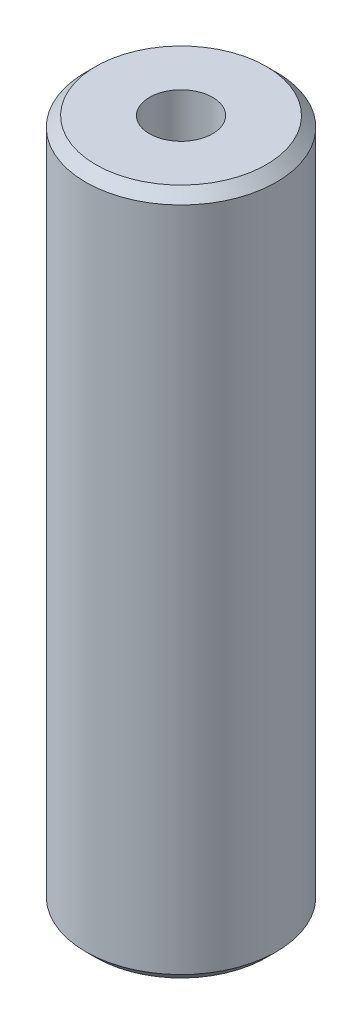
ISO-10303-21;
HEADER;
FILE_DESCRIPTION(('STEP AP214'),'2;1');
FILE_NAME('part.step','',(''),(''),'','','');
FILE_SCHEMA(('AUTOMOTIVE_DESIGN { 1 0 10303 214 1 1 1 1 }'));
ENDSEC;
DATA;
#1=APPLICATION_CONTEXT('core data for automotive mechanical design processes');
#2=APPLICATION_PROTOCOL_DEFINITION('international standard','automotive_design',2000,#1);
#3=PRODUCT_CONTEXT('',#1,'mechanical');
#4=PRODUCT('Part','Part','',(#3));
#5=PRODUCT_RELATED_PRODUCT_CATEGORY('part','',(#4));
#6=PRODUCT_DEFINITION_FORMATION('','',#4);
#7=PRODUCT_DEFINITION_CONTEXT('part definition',#1,'design');
#8=PRODUCT_DEFINITION('design','',#6,#7);
#9=PRODUCT_DEFINITION_SHAPE('','',#8);
#10=(LENGTH_UNIT() NAMED_UNIT(*) SI_UNIT(.MILLI.,.METRE.));
#11=(NAMED_UNIT(*) PLANE_ANGLE_UNIT() SI_UNIT($,.RADIAN.));
#12=(NAMED_UNIT(*) SI_UNIT($,.STERADIAN.) SOLID_ANGLE_UNIT());
#13=UNCERTAINTY_MEASURE_WITH_UNIT(LENGTH_MEASURE(1.E-05),#10,'distance_accuracy_value','');
#14=(GEOMETRIC_REPRESENTATION_CONTEXT(3) GLOBAL_UNCERTAINTY_ASSIGNED_CONTEXT((#13)) GLOBAL_UNIT_ASSIGNED_CONTEXT((#10,
#11,#12)) REPRESENTATION_CONTEXT('',''));
#15=CARTESIAN_POINT('',(0.,0.,0.));
#16=DIRECTION('',(0.,0.,1.));
#17=DIRECTION('',(1.,0.,0.));
#18=AXIS2_PLACEMENT_3D('',#15,#16,#17);
#19=CARTESIAN_POINT('',(0.,108.071181790834,0.));
#20=DIRECTION('',(0.,-1.,0.));
#21=DIRECTION('',(0.,0.,-1.));
#22=AXIS2_PLACEMENT_3D('',#19,#20,#21);
#23=CYLINDRICAL_SURFACE('',#22,15.);
#24=CARTESIAN_POINT('',(0.,106.479929511877,0.));
#25=DIRECTION('',(0.,1.,0.));
#26=DIRECTION('',(0.,0.,1.));
#27=AXIS2_PLACEMENT_3D('',#24,#25,#26);
#28=CIRCLE('',#27,15.);
#29=CARTESIAN_POINT('',(0.,106.479929511877,15.));
#30=VERTEX_POINT('',#29);
#31=EDGE_CURVE('E50',#30,#30,#28,.F.);
#32=ORIENTED_EDGE('',*,*,#31,.T.);
#33=EDGE_LOOP('',(#32));
#34=FACE_BOUND('',#33,.T.);
#35=CARTESIAN_POINT('',(0.,1.59125227895715,0.));
#36=DIRECTION('',(0.,1.,0.));
#37=DIRECTION('',(0.,0.,1.));
#38=AXIS2_PLACEMENT_3D('',#35,#36,#37);
#39=CIRCLE('',#38,15.);
#40=CARTESIAN_POINT('',(0.,1.59125227895715,15.));
#41=VERTEX_POINT('',#40);
#42=EDGE_CURVE('E51',#41,#41,#39,.T.);
#43=ORIENTED_EDGE('',*,*,#42,.T.);
#44=EDGE_LOOP('',(#43));
#45=FACE_BOUND('',#44,.T.);
#46=ADVANCED_FACE('F39',(#34,#45),#23,.T.);
#47=CARTESIAN_POINT('',(0.,108.071181790834,0.));
#48=DIRECTION('',(0.,1.,0.));
#49=DIRECTION('',(0.,0.,1.));
#50=AXIS2_PLACEMENT_3D('',#47,#48,#49);
#51=PLANE('',#50);
#52=CARTESIAN_POINT('',(0.,108.071181790834,0.));
#53=DIRECTION('',(0.,1.,0.));
#54=DIRECTION('',(0.,0.,1.));
#55=AXIS2_PLACEMENT_3D('',#52,#53,#54);
#56=CIRCLE('',#55,13.4087477210428);
#57=CARTESIAN_POINT('',(0.,108.071181790834,13.4087477210428));
#58=VERTEX_POINT('',#57);
#59=EDGE_CURVE('E54',#58,#58,#56,.T.);
#60=ORIENTED_EDGE('',*,*,#59,.T.);
#61=EDGE_LOOP('',(#60));
#62=FACE_BOUND('',#61,.T.);
#63=CARTESIAN_POINT('',(0.,108.071181790834,0.));
#64=DIRECTION('',(0.,1.,0.));
#65=DIRECTION('',(0.,0.,1.));
#66=AXIS2_PLACEMENT_3D('',#63,#64,#65);
#67=CIRCLE('',#66,4.97144902155037);
#68=CARTESIAN_POINT('',(0.,108.071181790834,4.97144902155037));
#69=VERTEX_POINT('',#68);
#70=EDGE_CURVE('E58',#69,#69,#67,.T.);
#71=ORIENTED_EDGE('',*,*,#70,.F.);
#72=EDGE_LOOP('',(#71));
#73=FACE_BOUND('',#72,.T.);
#74=ADVANCED_FACE('F69',(#62,#73),#51,.T.);
#75=CARTESIAN_POINT('',(0.,0.,0.));
#76=DIRECTION('',(0.,1.,0.));
#77=DIRECTION('',(0.,0.,1.));
#78=AXIS2_PLACEMENT_3D('',#75,#76,#77);
#79=PLANE('',#78);
#80=CARTESIAN_POINT('',(0.,0.,0.));
#81=DIRECTION('',(0.,1.,0.));
#82=DIRECTION('',(0.,0.,1.));
#83=AXIS2_PLACEMENT_3D('',#80,#81,#82);
#84=CIRCLE('',#83,13.4087477210428);
#85=CARTESIAN_POINT('',(0.,0.,13.4087477210428));
#86=VERTEX_POINT('',#85);
#87=EDGE_CURVE('E10',#86,#86,#84,.F.);
#88=ORIENTED_EDGE('',*,*,#87,.T.);
#89=EDGE_LOOP('',(#88));
#90=FACE_BOUND('',#89,.T.);
#91=CARTESIAN_POINT('',(0.,0.,0.));
#92=DIRECTION('',(0.,1.,0.));
#93=DIRECTION('',(0.,0.,1.));
#94=AXIS2_PLACEMENT_3D('',#91,#92,#93);
#95=CIRCLE('',#94,4.97144902155037);
#96=CARTESIAN_POINT('',(0.,0.,4.97144902155037));
#97=VERTEX_POINT('',#96);
#98=EDGE_CURVE('E63',#97,#97,#95,.T.);
#99=ORIENTED_EDGE('',*,*,#98,.T.);
#100=EDGE_LOOP('',(#99));
#101=FACE_BOUND('',#100,.T.);
#102=ADVANCED_FACE('F75',(#90,#101),#79,.F.);
#103=CARTESIAN_POINT('',(0.,108.071181790834,0.));
#104=DIRECTION('',(0.,-1.,0.));
#105=DIRECTION('',(0.,0.,-1.));
#106=AXIS2_PLACEMENT_3D('',#103,#104,#105);
#107=CYLINDRICAL_SURFACE('',#106,4.97144902155037);
#108=ORIENTED_EDGE('',*,*,#70,.T.);
#109=EDGE_LOOP('',(#108));
#110=FACE_BOUND('',#109,.T.);
#111=ORIENTED_EDGE('',*,*,#98,.F.);
#112=EDGE_LOOP('',(#111));
#113=FACE_BOUND('',#112,.T.);
#114=ADVANCED_FACE('F70',(#110,#113),#107,.F.);
#115=CARTESIAN_POINT('',(0.,108.071181790834,0.));
#116=DIRECTION('',(0.,-1.,0.));
#117=DIRECTION('',(0.,0.,-1.));
#118=AXIS2_PLACEMENT_3D('',#115,#116,#117);
#119=CONICAL_SURFACE('',#118,13.4087477210428,0.785398163397444);
#120=ORIENTED_EDGE('',*,*,#31,.F.);
#121=EDGE_LOOP('',(#120));
#122=FACE_BOUND('',#121,.T.);
#123=ORIENTED_EDGE('',*,*,#59,.F.);
#124=EDGE_LOOP('',(#123));
#125=FACE_BOUND('',#124,.T.);
#126=ADVANCED_FACE('F81',(#122,#125),#119,.T.);
#127=CARTESIAN_POINT('',(0.,1.59125227895715,0.));
#128=DIRECTION('',(0.,1.,0.));
#129=DIRECTION('',(0.,0.,1.));
#130=AXIS2_PLACEMENT_3D('',#127,#128,#129);
#131=CONICAL_SURFACE('',#130,15.,0.785398163397448);
#132=ORIENTED_EDGE('',*,*,#87,.F.);
#133=EDGE_LOOP('',(#132));
#134=FACE_BOUND('',#133,.T.);
#135=ORIENTED_EDGE('',*,*,#42,.F.);
#136=EDGE_LOOP('',(#135));
#137=FACE_BOUND('',#136,.T.);
#138=ADVANCED_FACE('F45',(#134,#137),#131,.T.);
#139=CLOSED_SHELL('',(#46,#74,#102,#114,#126,#138));
#140=MANIFOLD_SOLID_BREP('B2',#139);
#141=ADVANCED_BREP_SHAPE_REPRESENTATION('',(#18,#140),#14);
#142=SHAPE_DEFINITION_REPRESENTATION(#9,#141);
ENDSEC;
END-ISO-10303-21;
